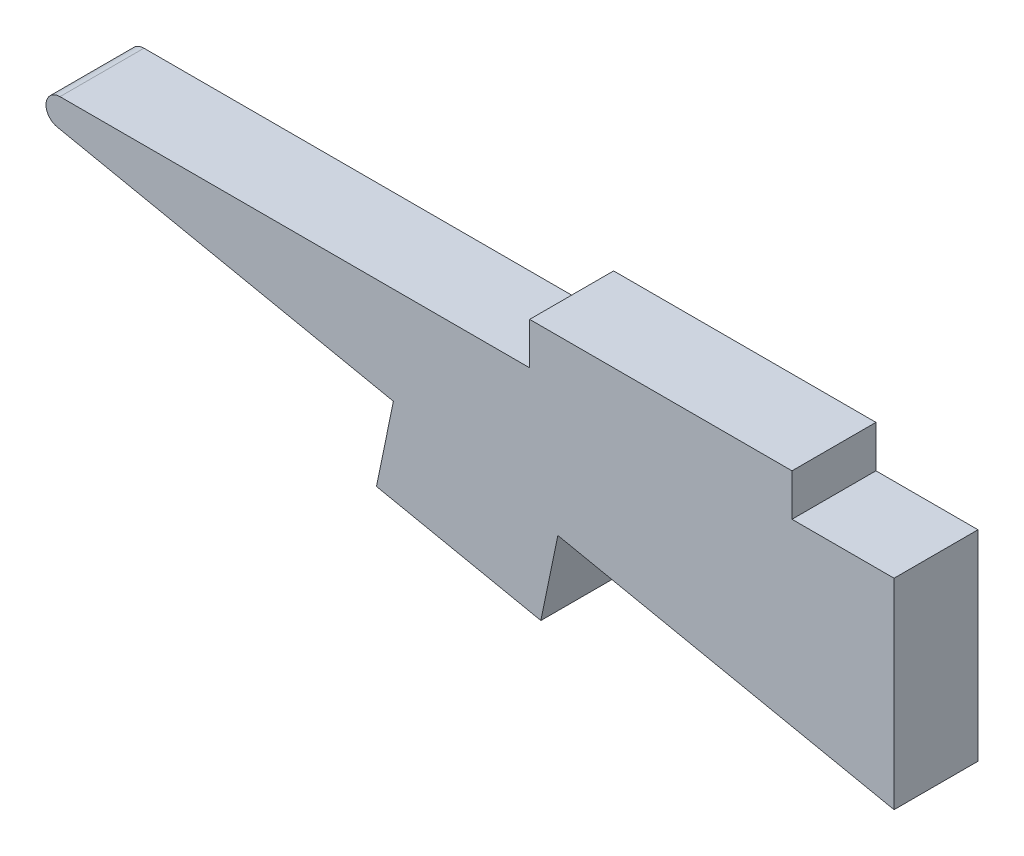
ISO-10303-21;
HEADER;
FILE_DESCRIPTION(('STEP AP214'),'2;1');
FILE_NAME('part.step','',(''),(''),'','','');
FILE_SCHEMA(('AUTOMOTIVE_DESIGN { 1 0 10303 214 1 1 1 1 }'));
ENDSEC;
DATA;
#1=APPLICATION_CONTEXT('core data for automotive mechanical design processes');
#2=APPLICATION_PROTOCOL_DEFINITION('international standard','automotive_design',2000,#1);
#3=PRODUCT_CONTEXT('',#1,'mechanical');
#4=PRODUCT('Part','Part','',(#3));
#5=PRODUCT_RELATED_PRODUCT_CATEGORY('part','',(#4));
#6=PRODUCT_DEFINITION_FORMATION('','',#4);
#7=PRODUCT_DEFINITION_CONTEXT('part definition',#1,'design');
#8=PRODUCT_DEFINITION('design','',#6,#7);
#9=PRODUCT_DEFINITION_SHAPE('','',#8);
#10=(LENGTH_UNIT() NAMED_UNIT(*) SI_UNIT(.MILLI.,.METRE.));
#11=(NAMED_UNIT(*) PLANE_ANGLE_UNIT() SI_UNIT($,.RADIAN.));
#12=(NAMED_UNIT(*) SI_UNIT($,.STERADIAN.) SOLID_ANGLE_UNIT());
#13=UNCERTAINTY_MEASURE_WITH_UNIT(LENGTH_MEASURE(1.E-05),#10,'distance_accuracy_value','');
#14=(GEOMETRIC_REPRESENTATION_CONTEXT(3) GLOBAL_UNCERTAINTY_ASSIGNED_CONTEXT((#13)) GLOBAL_UNIT_ASSIGNED_CONTEXT((#10,
#11,#12)) REPRESENTATION_CONTEXT('',''));
#15=CARTESIAN_POINT('',(0.,0.,0.));
#16=DIRECTION('',(0.,0.,1.));
#17=DIRECTION('',(1.,0.,0.));
#18=AXIS2_PLACEMENT_3D('',#15,#16,#17);
#19=CARTESIAN_POINT('',(-11.049,-0.762,1.524));
#20=DIRECTION('',(0.,-1.,0.));
#21=DIRECTION('',(0.,0.,-1.));
#22=AXIS2_PLACEMENT_3D('',#19,#20,#21);
#23=PLANE('',#22);
#24=DIRECTION('',(-1.,0.,0.));
#25=VECTOR('',#24,1.);
#26=CARTESIAN_POINT('',(-11.049,-0.762,0.));
#27=LINE('',#26,#25);
#28=CARTESIAN_POINT('',(-6.2865,-0.762,0.));
#29=VERTEX_POINT('',#28);
#30=CARTESIAN_POINT('',(-11.049,-0.762,0.));
#31=VERTEX_POINT('',#30);
#32=EDGE_CURVE('E145',#29,#31,#27,.T.);
#33=ORIENTED_EDGE('',*,*,#32,.T.);
#34=DIRECTION('',(0.,0.,-1.));
#35=VECTOR('',#34,1.);
#36=CARTESIAN_POINT('',(-11.049,-0.762,1.524));
#37=LINE('',#36,#35);
#38=CARTESIAN_POINT('',(-11.049,-0.762,1.524));
#39=VERTEX_POINT('',#38);
#40=EDGE_CURVE('E127',#39,#31,#37,.T.);
#41=ORIENTED_EDGE('',*,*,#40,.F.);
#42=DIRECTION('',(-1.,0.,0.));
#43=VECTOR('',#42,1.);
#44=CARTESIAN_POINT('',(-11.049,-0.762,1.524));
#45=LINE('',#44,#43);
#46=CARTESIAN_POINT('',(-6.2865,-0.762,1.524));
#47=VERTEX_POINT('',#46);
#48=EDGE_CURVE('E133',#47,#39,#45,.T.);
#49=ORIENTED_EDGE('',*,*,#48,.F.);
#50=DIRECTION('',(0.,0.,-1.));
#51=VECTOR('',#50,1.);
#52=CARTESIAN_POINT('',(-6.2865,-0.762,1.524));
#53=LINE('',#52,#51);
#54=EDGE_CURVE('E174',#47,#29,#53,.T.);
#55=ORIENTED_EDGE('',*,*,#54,.T.);
#56=EDGE_LOOP('',(#33,#41,#49,#55));
#57=FACE_BOUND('',#56,.T.);
#58=ADVANCED_FACE('F34',(#57),#23,.F.);
#59=CARTESIAN_POINT('',(-11.049,-0.762,1.524));
#60=DIRECTION('',(1.,0.,0.));
#61=DIRECTION('',(0.,0.,-1.));
#62=AXIS2_PLACEMENT_3D('',#59,#60,#61);
#63=PLANE('',#62);
#64=DIRECTION('',(0.,-1.,0.));
#65=VECTOR('',#64,1.);
#66=CARTESIAN_POINT('',(-11.049,-0.762,0.));
#67=LINE('',#66,#65);
#68=CARTESIAN_POINT('',(-11.049,-1.524,0.));
#69=VERTEX_POINT('',#68);
#70=EDGE_CURVE('E193',#31,#69,#67,.T.);
#71=ORIENTED_EDGE('',*,*,#70,.T.);
#72=DIRECTION('',(0.,0.,-1.));
#73=VECTOR('',#72,1.);
#74=CARTESIAN_POINT('',(-11.049,-1.524,1.524));
#75=LINE('',#74,#73);
#76=CARTESIAN_POINT('',(-11.049,-1.524,1.524));
#77=VERTEX_POINT('',#76);
#78=EDGE_CURVE('E130',#77,#69,#75,.T.);
#79=ORIENTED_EDGE('',*,*,#78,.F.);
#80=DIRECTION('',(0.,-1.,0.));
#81=VECTOR('',#80,1.);
#82=CARTESIAN_POINT('',(-11.049,-0.762,1.524));
#83=LINE('',#82,#81);
#84=EDGE_CURVE('E123',#39,#77,#83,.T.);
#85=ORIENTED_EDGE('',*,*,#84,.F.);
#86=ORIENTED_EDGE('',*,*,#40,.T.);
#87=EDGE_LOOP('',(#71,#79,#85,#86));
#88=FACE_BOUND('',#87,.T.);
#89=ADVANCED_FACE('F125',(#88),#63,.F.);
#90=CARTESIAN_POINT('',(-11.049,-1.524,1.524));
#91=DIRECTION('',(0.,-1.,0.));
#92=DIRECTION('',(0.,0.,-1.));
#93=AXIS2_PLACEMENT_3D('',#90,#91,#92);
#94=PLANE('',#93);
#95=DIRECTION('',(-1.,0.,0.));
#96=VECTOR('',#95,1.);
#97=CARTESIAN_POINT('',(-11.049,-1.524,0.));
#98=LINE('',#97,#96);
#99=CARTESIAN_POINT('',(-19.5759424912646,-1.524,0.));
#100=VERTEX_POINT('',#99);
#101=EDGE_CURVE('E191',#69,#100,#98,.T.);
#102=ORIENTED_EDGE('',*,*,#101,.T.);
#103=DIRECTION('',(0.,0.,-1.));
#104=VECTOR('',#103,1.);
#105=CARTESIAN_POINT('',(-19.5759424912646,-1.524,1.524));
#106=LINE('',#105,#104);
#107=CARTESIAN_POINT('',(-19.5759424912646,-1.524,1.524));
#108=VERTEX_POINT('',#107);
#109=EDGE_CURVE('E42',#100,#108,#106,.F.);
#110=ORIENTED_EDGE('',*,*,#109,.T.);
#111=DIRECTION('',(-1.,0.,0.));
#112=VECTOR('',#111,1.);
#113=CARTESIAN_POINT('',(-11.049,-1.524,1.524));
#114=LINE('',#113,#112);
#115=EDGE_CURVE('E132',#77,#108,#114,.T.);
#116=ORIENTED_EDGE('',*,*,#115,.F.);
#117=ORIENTED_EDGE('',*,*,#78,.T.);
#118=EDGE_LOOP('',(#102,#110,#116,#117));
#119=FACE_BOUND('',#118,.T.);
#120=ADVANCED_FACE('F252',(#119),#94,.F.);
#121=CARTESIAN_POINT('',(-22.0621518884627,-1.524,1.524));
#122=DIRECTION('',(0.202216504569402,0.979340842240194,0.));
#123=DIRECTION('',(-0.979340842240194,0.202216504569402,0.));
#124=AXIS2_PLACEMENT_3D('',#121,#122,#123);
#125=PLANE('',#124);
#126=DIRECTION('',(0.979340842240194,-0.202216504569402,0.));
#127=VECTOR('',#126,1.);
#128=CARTESIAN_POINT('',(-22.0621518884627,-1.524,1.524));
#129=LINE('',#128,#127);
#130=CARTESIAN_POINT('',(-19.6273054834252,-2.02675257392901,1.524));
#131=VERTEX_POINT('',#130);
#132=CARTESIAN_POINT('',(-13.5225368539471,-3.28727896087534,1.524));
#133=VERTEX_POINT('',#132);
#134=EDGE_CURVE('E209',#131,#133,#129,.T.);
#135=ORIENTED_EDGE('',*,*,#134,.F.);
#136=DIRECTION('',(0.,0.,-1.));
#137=VECTOR('',#136,1.);
#138=CARTESIAN_POINT('',(-19.6273054834252,-2.02675257392901,1.524));
#139=LINE('',#138,#137);
#140=CARTESIAN_POINT('',(-19.6273054834252,-2.02675257392901,0.));
#141=VERTEX_POINT('',#140);
#142=EDGE_CURVE('E146',#131,#141,#139,.T.);
#143=ORIENTED_EDGE('',*,*,#142,.T.);
#144=DIRECTION('',(0.979340842240194,-0.202216504569402,0.));
#145=VECTOR('',#144,1.);
#146=CARTESIAN_POINT('',(-22.0621518884627,-1.524,0.));
#147=LINE('',#146,#145);
#148=CARTESIAN_POINT('',(-13.5225368539471,-3.28727896087534,0.));
#149=VERTEX_POINT('',#148);
#150=EDGE_CURVE('E189',#141,#149,#147,.T.);
#151=ORIENTED_EDGE('',*,*,#150,.T.);
#152=DIRECTION('',(0.,0.,-1.));
#153=VECTOR('',#152,1.);
#154=CARTESIAN_POINT('',(-13.5225368539471,-3.28727896087534,1.524));
#155=LINE('',#154,#153);
#156=EDGE_CURVE('E150',#133,#149,#155,.T.);
#157=ORIENTED_EDGE('',*,*,#156,.F.);
#158=EDGE_LOOP('',(#135,#143,#151,#157));
#159=FACE_BOUND('',#158,.T.);
#160=ADVANCED_FACE('F216',(#159),#125,.F.);
#161=CARTESIAN_POINT('',(-13.5225368539471,-3.28727896087534,1.524));
#162=DIRECTION('',(0.979340842240195,-0.202216504569399,0.));
#163=DIRECTION('',(0.2022165045694,0.979340842240195,0.));
#164=AXIS2_PLACEMENT_3D('',#161,#162,#163);
#165=PLANE('',#164);
#166=DIRECTION('',(-0.202216504569399,-0.979340842240195,0.));
#167=VECTOR('',#166,1.);
#168=CARTESIAN_POINT('',(-13.5225368539471,-3.28727896087534,0.));
#169=LINE('',#168,#167);
#170=CARTESIAN_POINT('',(-13.8307148069108,-4.77979440444939,0.));
#171=VERTEX_POINT('',#170);
#172=EDGE_CURVE('E187',#149,#171,#169,.T.);
#173=ORIENTED_EDGE('',*,*,#172,.T.);
#174=DIRECTION('',(0.,0.,-1.));
#175=VECTOR('',#174,1.);
#176=CARTESIAN_POINT('',(-13.8307148069108,-4.77979440444939,1.524));
#177=LINE('',#176,#175);
#178=CARTESIAN_POINT('',(-13.8307148069108,-4.77979440444939,1.524));
#179=VERTEX_POINT('',#178);
#180=EDGE_CURVE('E156',#179,#171,#177,.T.);
#181=ORIENTED_EDGE('',*,*,#180,.F.);
#182=DIRECTION('',(-0.202216504569399,-0.979340842240195,0.));
#183=VECTOR('',#182,1.);
#184=CARTESIAN_POINT('',(-13.5225368539471,-3.28727896087534,1.524));
#185=LINE('',#184,#183);
#186=EDGE_CURVE('E207',#133,#179,#185,.T.);
#187=ORIENTED_EDGE('',*,*,#186,.F.);
#188=ORIENTED_EDGE('',*,*,#156,.T.);
#189=EDGE_LOOP('',(#173,#181,#187,#188));
#190=FACE_BOUND('',#189,.T.);
#191=ADVANCED_FACE('F224',(#190),#165,.F.);
#192=CARTESIAN_POINT('',(-13.8307148069108,-4.77979440444939,1.524));
#193=DIRECTION('',(0.202216504569399,0.979340842240195,0.));
#194=DIRECTION('',(-0.979340842240195,0.2022165045694,0.));
#195=AXIS2_PLACEMENT_3D('',#192,#193,#194);
#196=PLANE('',#195);
#197=DIRECTION('',(0.979340842240195,-0.202216504569399,0.));
#198=VECTOR('',#197,1.);
#199=CARTESIAN_POINT('',(-13.8307148069108,-4.77979440444939,0.));
#200=LINE('',#199,#198);
#201=CARTESIAN_POINT('',(-10.8456839197627,-5.39615031037692,0.));
#202=VERTEX_POINT('',#201);
#203=EDGE_CURVE('E185',#171,#202,#200,.T.);
#204=ORIENTED_EDGE('',*,*,#203,.T.);
#205=DIRECTION('',(0.,0.,-1.));
#206=VECTOR('',#205,1.);
#207=CARTESIAN_POINT('',(-10.8456839197627,-5.39615031037692,1.524));
#208=LINE('',#207,#206);
#209=CARTESIAN_POINT('',(-10.8456839197627,-5.39615031037692,1.524));
#210=VERTEX_POINT('',#209);
#211=EDGE_CURVE('E159',#210,#202,#208,.T.);
#212=ORIENTED_EDGE('',*,*,#211,.F.);
#213=DIRECTION('',(0.979340842240195,-0.202216504569399,0.));
#214=VECTOR('',#213,1.);
#215=CARTESIAN_POINT('',(-13.8307148069108,-4.77979440444939,1.524));
#216=LINE('',#215,#214);
#217=EDGE_CURVE('E205',#179,#210,#216,.T.);
#218=ORIENTED_EDGE('',*,*,#217,.F.);
#219=ORIENTED_EDGE('',*,*,#180,.T.);
#220=EDGE_LOOP('',(#204,#212,#218,#219));
#221=FACE_BOUND('',#220,.T.);
#222=ADVANCED_FACE('F228',(#221),#196,.F.);
#223=CARTESIAN_POINT('',(-10.5375059667989,-3.90363486680287,1.524));
#224=DIRECTION('',(-0.979340842240195,0.202216504569399,0.));
#225=DIRECTION('',(-0.2022165045694,-0.979340842240195,0.));
#226=AXIS2_PLACEMENT_3D('',#223,#224,#225);
#227=PLANE('',#226);
#228=DIRECTION('',(0.202216504569399,0.979340842240195,0.));
#229=VECTOR('',#228,1.);
#230=CARTESIAN_POINT('',(-10.5375059667989,-3.90363486680287,0.));
#231=LINE('',#230,#229);
#232=CARTESIAN_POINT('',(-10.5375059667989,-3.90363486680287,0.));
#233=VERTEX_POINT('',#232);
#234=EDGE_CURVE('E183',#202,#233,#231,.T.);
#235=ORIENTED_EDGE('',*,*,#234,.T.);
#236=DIRECTION('',(0.,0.,-1.));
#237=VECTOR('',#236,1.);
#238=CARTESIAN_POINT('',(-10.5375059667989,-3.90363486680287,1.524));
#239=LINE('',#238,#237);
#240=CARTESIAN_POINT('',(-10.5375059667989,-3.90363486680287,1.524));
#241=VERTEX_POINT('',#240);
#242=EDGE_CURVE('E162',#241,#233,#239,.T.);
#243=ORIENTED_EDGE('',*,*,#242,.F.);
#244=DIRECTION('',(0.202216504569399,0.979340842240195,0.));
#245=VECTOR('',#244,1.);
#246=CARTESIAN_POINT('',(-10.5375059667989,-3.90363486680287,1.524));
#247=LINE('',#246,#245);
#248=EDGE_CURVE('E203',#210,#241,#247,.T.);
#249=ORIENTED_EDGE('',*,*,#248,.F.);
#250=ORIENTED_EDGE('',*,*,#211,.T.);
#251=EDGE_LOOP('',(#235,#243,#249,#250));
#252=FACE_BOUND('',#251,.T.);
#253=ADVANCED_FACE('F235',(#252),#227,.F.);
#254=CARTESIAN_POINT('',(-10.5375059667989,-3.90363486680287,1.524));
#255=DIRECTION('',(0.202216504569402,0.979340842240194,0.));
#256=DIRECTION('',(-0.979340842240194,0.202216504569402,0.));
#257=AXIS2_PLACEMENT_3D('',#254,#255,#256);
#258=PLANE('',#257);
#259=DIRECTION('',(0.979340842240194,-0.202216504569402,0.));
#260=VECTOR('',#259,1.);
#261=CARTESIAN_POINT('',(-10.5375059667989,-3.90363486680287,0.));
#262=LINE('',#261,#260);
#263=CARTESIAN_POINT('',(-4.43352452867884,-5.16399871270323,0.));
#264=VERTEX_POINT('',#263);
#265=EDGE_CURVE('E181',#233,#264,#262,.T.);
#266=ORIENTED_EDGE('',*,*,#265,.T.);
#267=DIRECTION('',(0.,0.,-1.));
#268=VECTOR('',#267,1.);
#269=CARTESIAN_POINT('',(-4.43352452867884,-5.16399871270323,1.524));
#270=LINE('',#269,#268);
#271=CARTESIAN_POINT('',(-4.43352452867884,-5.16399871270323,1.524));
#272=VERTEX_POINT('',#271);
#273=EDGE_CURVE('E165',#272,#264,#270,.T.);
#274=ORIENTED_EDGE('',*,*,#273,.F.);
#275=DIRECTION('',(0.979340842240194,-0.202216504569402,0.));
#276=VECTOR('',#275,1.);
#277=CARTESIAN_POINT('',(-10.5375059667989,-3.90363486680287,1.524));
#278=LINE('',#277,#276);
#279=EDGE_CURVE('E201',#241,#272,#278,.T.);
#280=ORIENTED_EDGE('',*,*,#279,.F.);
#281=ORIENTED_EDGE('',*,*,#242,.T.);
#282=EDGE_LOOP('',(#266,#274,#280,#281));
#283=FACE_BOUND('',#282,.T.);
#284=ADVANCED_FACE('F238',(#283),#258,.F.);
#285=CARTESIAN_POINT('',(-4.43352452867885,-1.524,1.524));
#286=DIRECTION('',(-1.,0.,0.));
#287=DIRECTION('',(0.,-1.,0.));
#288=AXIS2_PLACEMENT_3D('',#285,#286,#287);
#289=PLANE('',#288);
#290=DIRECTION('',(0.,1.,0.));
#291=VECTOR('',#290,1.);
#292=CARTESIAN_POINT('',(-4.43352452867885,-1.524,0.));
#293=LINE('',#292,#291);
#294=CARTESIAN_POINT('',(-4.43352452867885,-1.524,0.));
#295=VERTEX_POINT('',#294);
#296=EDGE_CURVE('E179',#264,#295,#293,.T.);
#297=ORIENTED_EDGE('',*,*,#296,.T.);
#298=DIRECTION('',(0.,0.,-1.));
#299=VECTOR('',#298,1.);
#300=CARTESIAN_POINT('',(-4.43352452867885,-1.524,1.524));
#301=LINE('',#300,#299);
#302=CARTESIAN_POINT('',(-4.43352452867885,-1.524,1.524));
#303=VERTEX_POINT('',#302);
#304=EDGE_CURVE('E168',#303,#295,#301,.T.);
#305=ORIENTED_EDGE('',*,*,#304,.F.);
#306=DIRECTION('',(0.,1.,0.));
#307=VECTOR('',#306,1.);
#308=CARTESIAN_POINT('',(-4.43352452867885,-1.524,1.524));
#309=LINE('',#308,#307);
#310=EDGE_CURVE('E199',#272,#303,#309,.T.);
#311=ORIENTED_EDGE('',*,*,#310,.F.);
#312=ORIENTED_EDGE('',*,*,#273,.T.);
#313=EDGE_LOOP('',(#297,#305,#311,#312));
#314=FACE_BOUND('',#313,.T.);
#315=ADVANCED_FACE('F243',(#314),#289,.F.);
#316=CARTESIAN_POINT('',(-6.2865,-1.524,1.524));
#317=DIRECTION('',(0.,-1.,0.));
#318=DIRECTION('',(0.,0.,-1.));
#319=AXIS2_PLACEMENT_3D('',#316,#317,#318);
#320=PLANE('',#319);
#321=DIRECTION('',(-1.,0.,0.));
#322=VECTOR('',#321,1.);
#323=CARTESIAN_POINT('',(-6.2865,-1.524,0.));
#324=LINE('',#323,#322);
#325=CARTESIAN_POINT('',(-6.2865,-1.524,0.));
#326=VERTEX_POINT('',#325);
#327=EDGE_CURVE('E177',#295,#326,#324,.T.);
#328=ORIENTED_EDGE('',*,*,#327,.T.);
#329=DIRECTION('',(0.,0.,-1.));
#330=VECTOR('',#329,1.);
#331=CARTESIAN_POINT('',(-6.2865,-1.524,1.524));
#332=LINE('',#331,#330);
#333=CARTESIAN_POINT('',(-6.2865,-1.524,1.524));
#334=VERTEX_POINT('',#333);
#335=EDGE_CURVE('E171',#334,#326,#332,.T.);
#336=ORIENTED_EDGE('',*,*,#335,.F.);
#337=DIRECTION('',(-1.,0.,0.));
#338=VECTOR('',#337,1.);
#339=CARTESIAN_POINT('',(-6.2865,-1.524,1.524));
#340=LINE('',#339,#338);
#341=EDGE_CURVE('E197',#303,#334,#340,.T.);
#342=ORIENTED_EDGE('',*,*,#341,.F.);
#343=ORIENTED_EDGE('',*,*,#304,.T.);
#344=EDGE_LOOP('',(#328,#336,#342,#343));
#345=FACE_BOUND('',#344,.T.);
#346=ADVANCED_FACE('F247',(#345),#320,.F.);
#347=CARTESIAN_POINT('',(-6.2865,-0.762,1.524));
#348=DIRECTION('',(-1.,0.,0.));
#349=DIRECTION('',(0.,0.,1.));
#350=AXIS2_PLACEMENT_3D('',#347,#348,#349);
#351=PLANE('',#350);
#352=DIRECTION('',(0.,1.,0.));
#353=VECTOR('',#352,1.);
#354=CARTESIAN_POINT('',(-6.2865,-0.762,0.));
#355=LINE('',#354,#353);
#356=EDGE_CURVE('E142',#326,#29,#355,.T.);
#357=ORIENTED_EDGE('',*,*,#356,.T.);
#358=ORIENTED_EDGE('',*,*,#54,.F.);
#359=DIRECTION('',(0.,1.,0.));
#360=VECTOR('',#359,1.);
#361=CARTESIAN_POINT('',(-6.2865,-0.762,1.524));
#362=LINE('',#361,#360);
#363=EDGE_CURVE('E138',#334,#47,#362,.T.);
#364=ORIENTED_EDGE('',*,*,#363,.F.);
#365=ORIENTED_EDGE('',*,*,#335,.T.);
#366=EDGE_LOOP('',(#357,#358,#364,#365));
#367=FACE_BOUND('',#366,.T.);
#368=ADVANCED_FACE('F251',(#367),#351,.F.);
#369=CARTESIAN_POINT('',(0.,0.,1.524));
#370=DIRECTION('',(0.,0.,-1.));
#371=DIRECTION('',(-1.,0.,0.));
#372=AXIS2_PLACEMENT_3D('',#369,#370,#371);
#373=PLANE('',#372);
#374=ORIENTED_EDGE('',*,*,#115,.T.);
#375=CARTESIAN_POINT('',(-19.5759424912646,-1.778,1.524));
#376=DIRECTION('',(0.,0.,-1.));
#377=DIRECTION('',(-1.,0.,0.));
#378=AXIS2_PLACEMENT_3D('',#375,#376,#377);
#379=CIRCLE('',#378,0.254);
#380=EDGE_CURVE('E11',#108,#131,#379,.F.);
#381=ORIENTED_EDGE('',*,*,#380,.T.);
#382=ORIENTED_EDGE('',*,*,#134,.T.);
#383=ORIENTED_EDGE('',*,*,#186,.T.);
#384=ORIENTED_EDGE('',*,*,#217,.T.);
#385=ORIENTED_EDGE('',*,*,#248,.T.);
#386=ORIENTED_EDGE('',*,*,#279,.T.);
#387=ORIENTED_EDGE('',*,*,#310,.T.);
#388=ORIENTED_EDGE('',*,*,#341,.T.);
#389=ORIENTED_EDGE('',*,*,#363,.T.);
#390=ORIENTED_EDGE('',*,*,#48,.T.);
#391=ORIENTED_EDGE('',*,*,#84,.T.);
#392=EDGE_LOOP('',(#374,#381,#382,#383,#384,#385,#386,#387,#388,#389,#390,#391));
#393=FACE_BOUND('',#392,.T.);
#394=ADVANCED_FACE('F136',(#393),#373,.F.);
#395=CARTESIAN_POINT('',(0.,0.,0.));
#396=DIRECTION('',(0.,0.,-1.));
#397=DIRECTION('',(-1.,0.,0.));
#398=AXIS2_PLACEMENT_3D('',#395,#396,#397);
#399=PLANE('',#398);
#400=ORIENTED_EDGE('',*,*,#150,.F.);
#401=CARTESIAN_POINT('',(-19.5759424912646,-1.778,0.));
#402=DIRECTION('',(0.,0.,-1.));
#403=DIRECTION('',(-1.,0.,0.));
#404=AXIS2_PLACEMENT_3D('',#401,#402,#403);
#405=CIRCLE('',#404,0.254);
#406=EDGE_CURVE('E56',#141,#100,#405,.T.);
#407=ORIENTED_EDGE('',*,*,#406,.T.);
#408=ORIENTED_EDGE('',*,*,#101,.F.);
#409=ORIENTED_EDGE('',*,*,#70,.F.);
#410=ORIENTED_EDGE('',*,*,#32,.F.);
#411=ORIENTED_EDGE('',*,*,#356,.F.);
#412=ORIENTED_EDGE('',*,*,#327,.F.);
#413=ORIENTED_EDGE('',*,*,#296,.F.);
#414=ORIENTED_EDGE('',*,*,#265,.F.);
#415=ORIENTED_EDGE('',*,*,#234,.F.);
#416=ORIENTED_EDGE('',*,*,#203,.F.);
#417=ORIENTED_EDGE('',*,*,#172,.F.);
#418=EDGE_LOOP('',(#400,#407,#408,#409,#410,#411,#412,#413,#414,#415,#416,#417));
#419=FACE_BOUND('',#418,.T.);
#420=ADVANCED_FACE('F219',(#419),#399,.T.);
#421=CARTESIAN_POINT('',(-19.5759424912646,-1.778,1.524));
#422=DIRECTION('',(0.,0.,-1.));
#423=DIRECTION('',(-1.,0.,0.));
#424=AXIS2_PLACEMENT_3D('',#421,#422,#423);
#425=CYLINDRICAL_SURFACE('',#424,0.254);
#426=ORIENTED_EDGE('',*,*,#380,.F.);
#427=ORIENTED_EDGE('',*,*,#109,.F.);
#428=ORIENTED_EDGE('',*,*,#406,.F.);
#429=ORIENTED_EDGE('',*,*,#142,.F.);
#430=EDGE_LOOP('',(#426,#427,#428,#429));
#431=FACE_BOUND('',#430,.T.);
#432=ADVANCED_FACE('F36',(#431),#425,.T.);
#433=CLOSED_SHELL('',(#58,#89,#120,#160,#191,#222,#253,#284,#315,#346,#368,#394,#420,#432));
#434=MANIFOLD_SOLID_BREP('B2',#433);
#435=ADVANCED_BREP_SHAPE_REPRESENTATION('',(#18,#434),#14);
#436=SHAPE_DEFINITION_REPRESENTATION(#9,#435);
ENDSEC;
END-ISO-10303-21;
